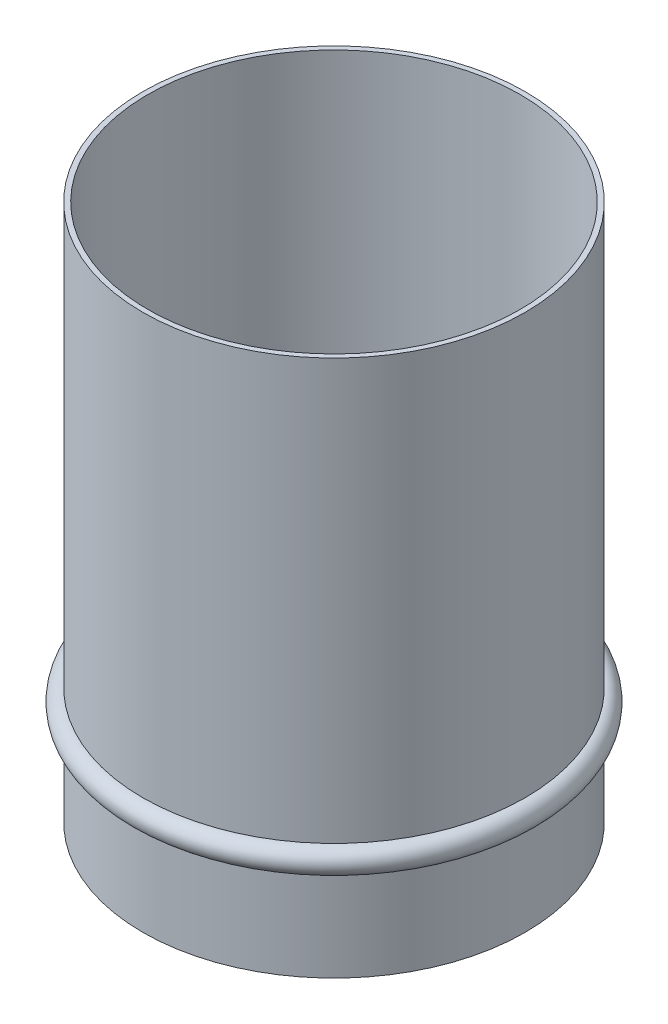
ISO-10303-21;
HEADER;
FILE_DESCRIPTION(('STEP AP214'),'2;1');
FILE_NAME('part.step','',(''),(''),'','','');
FILE_SCHEMA(('AUTOMOTIVE_DESIGN { 1 0 10303 214 1 1 1 1 }'));
ENDSEC;
DATA;
#1=APPLICATION_CONTEXT('core data for automotive mechanical design processes');
#2=APPLICATION_PROTOCOL_DEFINITION('international standard','automotive_design',2000,#1);
#3=PRODUCT_CONTEXT('',#1,'mechanical');
#4=PRODUCT('Part','Part','',(#3));
#5=PRODUCT_RELATED_PRODUCT_CATEGORY('part','',(#4));
#6=PRODUCT_DEFINITION_FORMATION('','',#4);
#7=PRODUCT_DEFINITION_CONTEXT('part definition',#1,'design');
#8=PRODUCT_DEFINITION('design','',#6,#7);
#9=PRODUCT_DEFINITION_SHAPE('','',#8);
#10=(LENGTH_UNIT() NAMED_UNIT(*) SI_UNIT(.MILLI.,.METRE.));
#11=(NAMED_UNIT(*) PLANE_ANGLE_UNIT() SI_UNIT($,.RADIAN.));
#12=(NAMED_UNIT(*) SI_UNIT($,.STERADIAN.) SOLID_ANGLE_UNIT());
#13=UNCERTAINTY_MEASURE_WITH_UNIT(LENGTH_MEASURE(1.E-05),#10,'distance_accuracy_value','');
#14=(GEOMETRIC_REPRESENTATION_CONTEXT(3) GLOBAL_UNCERTAINTY_ASSIGNED_CONTEXT((#13)) GLOBAL_UNIT_ASSIGNED_CONTEXT((#10,
#11,#12)) REPRESENTATION_CONTEXT('',''));
#15=CARTESIAN_POINT('',(0.,0.,0.));
#16=DIRECTION('',(0.,0.,1.));
#17=DIRECTION('',(1.,0.,0.));
#18=AXIS2_PLACEMENT_3D('',#15,#16,#17);
#19=CARTESIAN_POINT('',(0.,-159.32145483356,0.));
#20=DIRECTION('',(0.,-1.,0.));
#21=DIRECTION('',(0.,0.,-1.));
#22=AXIS2_PLACEMENT_3D('',#19,#20,#21);
#23=TOROIDAL_SURFACE('',#22,182.5625,11.9092798026372);
#24=CARTESIAN_POINT('',(0.,-171.230734636197,0.));
#25=DIRECTION('',(0.,-1.,0.));
#26=DIRECTION('',(0.,0.,-1.));
#27=AXIS2_PLACEMENT_3D('',#24,#25,#26);
#28=CIRCLE('',#27,182.5625);
#29=CARTESIAN_POINT('',(0.,-171.230734636197,-182.5625));
#30=VERTEX_POINT('',#29);
#31=EDGE_CURVE('E46',#30,#30,#28,.T.);
#32=ORIENTED_EDGE('',*,*,#31,.F.);
#33=EDGE_LOOP('',(#32));
#34=FACE_BOUND('',#33,.T.);
#35=CARTESIAN_POINT('',(0.,-147.412175030922,0.));
#36=DIRECTION('',(0.,-1.,0.));
#37=DIRECTION('',(0.,0.,-1.));
#38=AXIS2_PLACEMENT_3D('',#35,#36,#37);
#39=CIRCLE('',#38,182.5625);
#40=CARTESIAN_POINT('',(0.,-147.412175030922,-182.5625));
#41=VERTEX_POINT('',#40);
#42=EDGE_CURVE('E10',#41,#41,#39,.T.);
#43=ORIENTED_EDGE('',*,*,#42,.T.);
#44=EDGE_LOOP('',(#43));
#45=FACE_BOUND('',#44,.T.);
#46=ADVANCED_FACE('F37',(#34,#45),#23,.T.);
#47=CARTESIAN_POINT('',(0.,-254.,0.));
#48=DIRECTION('',(0.,1.,0.));
#49=DIRECTION('',(0.,0.,1.));
#50=AXIS2_PLACEMENT_3D('',#47,#48,#49);
#51=PLANE('',#50);
#52=CARTESIAN_POINT('',(0.,-254.,0.));
#53=DIRECTION('',(0.,-1.,0.));
#54=DIRECTION('',(0.,0.,-1.));
#55=AXIS2_PLACEMENT_3D('',#52,#53,#54);
#56=CIRCLE('',#55,177.8);
#57=CARTESIAN_POINT('',(0.,-254.,-177.8));
#58=VERTEX_POINT('',#57);
#59=EDGE_CURVE('E61',#58,#58,#56,.T.);
#60=ORIENTED_EDGE('',*,*,#59,.F.);
#61=EDGE_LOOP('',(#60));
#62=FACE_BOUND('',#61,.T.);
#63=ADVANCED_FACE('F78',(#62),#51,.T.);
#64=CARTESIAN_POINT('',(0.,-254.,0.));
#65=DIRECTION('',(0.,-1.,0.));
#66=DIRECTION('',(0.,0.,-1.));
#67=AXIS2_PLACEMENT_3D('',#64,#65,#66);
#68=CYLINDRICAL_SURFACE('',#67,177.8);
#69=CARTESIAN_POINT('',(0.,254.,0.));
#70=DIRECTION('',(0.,-1.,0.));
#71=DIRECTION('',(0.,0.,-1.));
#72=AXIS2_PLACEMENT_3D('',#69,#70,#71);
#73=CIRCLE('',#72,177.8);
#74=CARTESIAN_POINT('',(0.,254.,-177.8));
#75=VERTEX_POINT('',#74);
#76=EDGE_CURVE('E53',#75,#75,#73,.T.);
#77=ORIENTED_EDGE('',*,*,#76,.F.);
#78=EDGE_LOOP('',(#77));
#79=FACE_BOUND('',#78,.T.);
#80=ORIENTED_EDGE('',*,*,#59,.T.);
#81=EDGE_LOOP('',(#80));
#82=FACE_BOUND('',#81,.T.);
#83=ADVANCED_FACE('F83',(#79,#82),#68,.F.);
#84=CARTESIAN_POINT('',(0.,254.,0.));
#85=DIRECTION('',(0.,-1.,0.));
#86=DIRECTION('',(0.,0.,-1.));
#87=AXIS2_PLACEMENT_3D('',#84,#85,#86);
#88=PLANE('',#87);
#89=CARTESIAN_POINT('',(0.,254.,0.));
#90=DIRECTION('',(0.,-1.,0.));
#91=DIRECTION('',(0.,0.,-1.));
#92=AXIS2_PLACEMENT_3D('',#89,#90,#91);
#93=CIRCLE('',#92,182.5625);
#94=CARTESIAN_POINT('',(0.,254.,-182.5625));
#95=VERTEX_POINT('',#94);
#96=EDGE_CURVE('E56',#95,#95,#93,.T.);
#97=ORIENTED_EDGE('',*,*,#96,.F.);
#98=EDGE_LOOP('',(#97));
#99=FACE_BOUND('',#98,.T.);
#100=ORIENTED_EDGE('',*,*,#76,.T.);
#101=EDGE_LOOP('',(#100));
#102=FACE_BOUND('',#101,.T.);
#103=ADVANCED_FACE('F89',(#99,#102),#88,.F.);
#104=CARTESIAN_POINT('',(0.,-254.,0.));
#105=DIRECTION('',(0.,-1.,0.));
#106=DIRECTION('',(0.,0.,-1.));
#107=AXIS2_PLACEMENT_3D('',#104,#105,#106);
#108=CYLINDRICAL_SURFACE('',#107,182.5625);
#109=ORIENTED_EDGE('',*,*,#42,.F.);
#110=EDGE_LOOP('',(#109));
#111=FACE_BOUND('',#110,.T.);
#112=ORIENTED_EDGE('',*,*,#96,.T.);
#113=EDGE_LOOP('',(#112));
#114=FACE_BOUND('',#113,.T.);
#115=ADVANCED_FACE('F74',(#111,#114),#108,.T.);
#116=CARTESIAN_POINT('',(0.,-258.7625,0.));
#117=DIRECTION('',(0.,1.,0.));
#118=DIRECTION('',(0.,0.,1.));
#119=AXIS2_PLACEMENT_3D('',#116,#117,#118);
#120=PLANE('',#119);
#121=CARTESIAN_POINT('',(0.,-258.7625,0.));
#122=DIRECTION('',(0.,-1.,0.));
#123=DIRECTION('',(0.,0.,-1.));
#124=AXIS2_PLACEMENT_3D('',#121,#122,#123);
#125=CIRCLE('',#124,182.5625);
#126=CARTESIAN_POINT('',(0.,-258.7625,-182.5625));
#127=VERTEX_POINT('',#126);
#128=EDGE_CURVE('E41',#127,#127,#125,.T.);
#129=ORIENTED_EDGE('',*,*,#128,.T.);
#130=EDGE_LOOP('',(#129));
#131=FACE_BOUND('',#130,.T.);
#132=ADVANCED_FACE('F70',(#131),#120,.F.);
#133=CARTESIAN_POINT('',(0.,-254.,0.));
#134=DIRECTION('',(0.,-1.,0.));
#135=DIRECTION('',(0.,0.,-1.));
#136=AXIS2_PLACEMENT_3D('',#133,#134,#135);
#137=CYLINDRICAL_SURFACE('',#136,182.5625);
#138=ORIENTED_EDGE('',*,*,#128,.F.);
#139=EDGE_LOOP('',(#138));
#140=FACE_BOUND('',#139,.T.);
#141=ORIENTED_EDGE('',*,*,#31,.T.);
#142=EDGE_LOOP('',(#141));
#143=FACE_BOUND('',#142,.T.);
#144=ADVANCED_FACE('F39',(#140,#143),#137,.T.);
#145=CLOSED_SHELL('',(#46,#63,#83,#103,#115,#132,#144));
#146=MANIFOLD_SOLID_BREP('B2',#145);
#147=ADVANCED_BREP_SHAPE_REPRESENTATION('',(#18,#146),#14);
#148=SHAPE_DEFINITION_REPRESENTATION(#9,#147);
ENDSEC;
END-ISO-10303-21;
